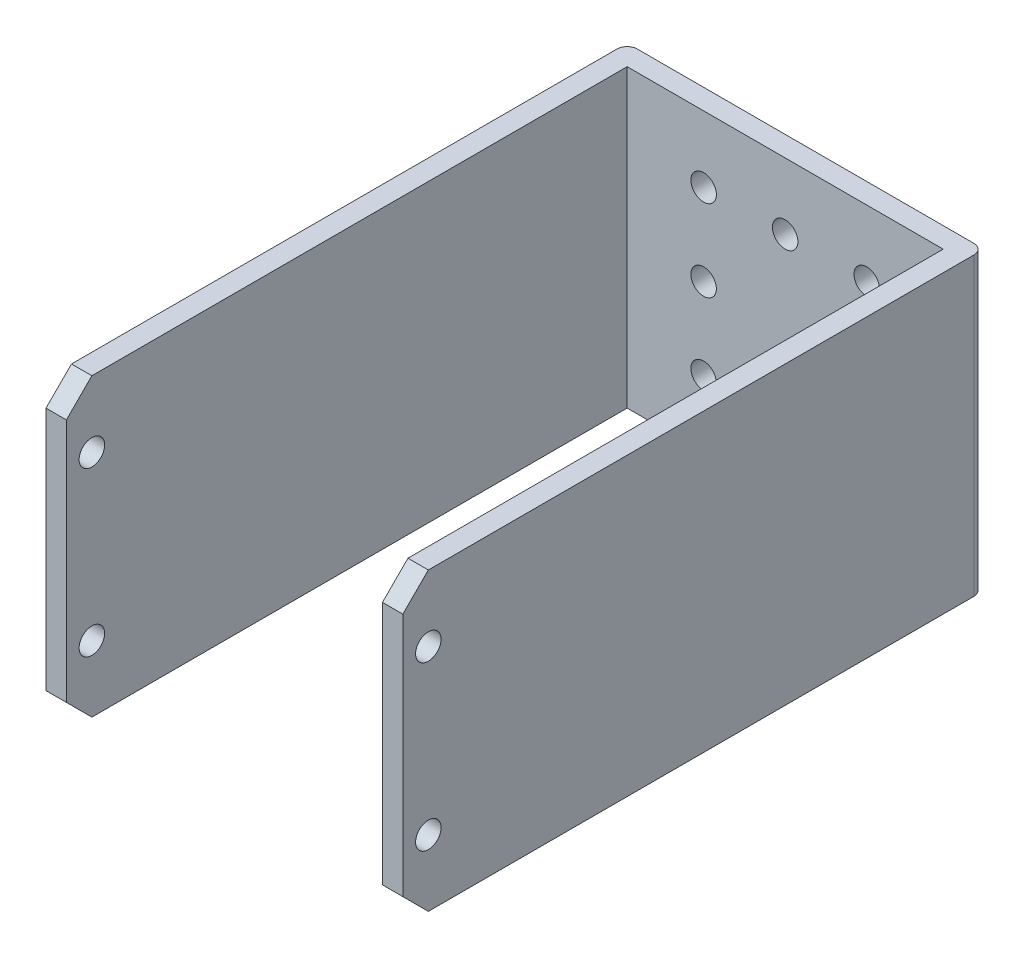
ISO-10303-21;
HEADER;
FILE_DESCRIPTION(('STEP AP214'),'2;1');
FILE_NAME('part.step','',(''),(''),'','','');
FILE_SCHEMA(('AUTOMOTIVE_DESIGN { 1 0 10303 214 1 1 1 1 }'));
ENDSEC;
DATA;
#1=APPLICATION_CONTEXT('core data for automotive mechanical design processes');
#2=APPLICATION_PROTOCOL_DEFINITION('international standard','automotive_design',2000,#1);
#3=PRODUCT_CONTEXT('',#1,'mechanical');
#4=PRODUCT('Part','Part','',(#3));
#5=PRODUCT_RELATED_PRODUCT_CATEGORY('part','',(#4));
#6=PRODUCT_DEFINITION_FORMATION('','',#4);
#7=PRODUCT_DEFINITION_CONTEXT('part definition',#1,'design');
#8=PRODUCT_DEFINITION('design','',#6,#7);
#9=PRODUCT_DEFINITION_SHAPE('','',#8);
#10=(LENGTH_UNIT() NAMED_UNIT(*) SI_UNIT(.MILLI.,.METRE.));
#11=(NAMED_UNIT(*) PLANE_ANGLE_UNIT() SI_UNIT($,.RADIAN.));
#12=(NAMED_UNIT(*) SI_UNIT($,.STERADIAN.) SOLID_ANGLE_UNIT());
#13=UNCERTAINTY_MEASURE_WITH_UNIT(LENGTH_MEASURE(1.E-05),#10,'distance_accuracy_value','');
#14=(GEOMETRIC_REPRESENTATION_CONTEXT(3) GLOBAL_UNCERTAINTY_ASSIGNED_CONTEXT((#13)) GLOBAL_UNIT_ASSIGNED_CONTEXT((#10,
#11,#12)) REPRESENTATION_CONTEXT('',''));
#15=CARTESIAN_POINT('',(0.,0.,0.));
#16=DIRECTION('',(0.,0.,1.));
#17=DIRECTION('',(1.,0.,0.));
#18=AXIS2_PLACEMENT_3D('',#15,#16,#17);
#19=CARTESIAN_POINT('',(0.,0.,57.));
#20=DIRECTION('',(0.,0.,1.));
#21=DIRECTION('',(1.,0.,0.));
#22=AXIS2_PLACEMENT_3D('',#19,#20,#21);
#23=PLANE('',#22);
#24=DIRECTION('',(0.,-1.,0.));
#25=VECTOR('',#24,1.);
#26=CARTESIAN_POINT('',(0.,0.,57.));
#27=LINE('',#26,#25);
#28=CARTESIAN_POINT('',(0.,26.5,57.));
#29=VERTEX_POINT('',#28);
#30=CARTESIAN_POINT('',(0.,2.5,57.));
#31=VERTEX_POINT('',#30);
#32=EDGE_CURVE('E193',#29,#31,#27,.T.);
#33=ORIENTED_EDGE('',*,*,#32,.T.);
#34=DIRECTION('',(1.,0.,0.));
#35=VECTOR('',#34,1.);
#36=CARTESIAN_POINT('',(2.,2.50000000000001,57.));
#37=LINE('',#36,#35);
#38=CARTESIAN_POINT('',(2.,2.50000000000001,57.));
#39=VERTEX_POINT('',#38);
#40=EDGE_CURVE('E250',#31,#39,#37,.T.);
#41=ORIENTED_EDGE('',*,*,#40,.T.);
#42=DIRECTION('',(0.,-1.,0.));
#43=VECTOR('',#42,1.);
#44=CARTESIAN_POINT('',(1.99999999999999,29.,57.));
#45=LINE('',#44,#43);
#46=CARTESIAN_POINT('',(1.99999999999999,26.5,57.));
#47=VERTEX_POINT('',#46);
#48=EDGE_CURVE('E178',#47,#39,#45,.T.);
#49=ORIENTED_EDGE('',*,*,#48,.F.);
#50=DIRECTION('',(-1.,0.,0.));
#51=VECTOR('',#50,1.);
#52=CARTESIAN_POINT('',(0.,26.5,57.));
#53=LINE('',#52,#51);
#54=EDGE_CURVE('E247',#47,#29,#53,.T.);
#55=ORIENTED_EDGE('',*,*,#54,.T.);
#56=EDGE_LOOP('',(#33,#41,#49,#55));
#57=FACE_BOUND('',#56,.T.);
#58=ADVANCED_FACE('F46',(#57),#23,.T.);
#59=CARTESIAN_POINT('',(35.,0.,57.));
#60=DIRECTION('',(-1.,0.,0.));
#61=DIRECTION('',(0.,0.,1.));
#62=AXIS2_PLACEMENT_3D('',#59,#60,#61);
#63=PLANE('',#62);
#64=CARTESIAN_POINT('',(35.,22.5,54.5));
#65=DIRECTION('',(-1.,0.,0.));
#66=DIRECTION('',(0.,0.,1.));
#67=AXIS2_PLACEMENT_3D('',#64,#65,#66);
#68=CIRCLE('',#67,1.25);
#69=CARTESIAN_POINT('',(35.,22.5,55.75));
#70=VERTEX_POINT('',#69);
#71=EDGE_CURVE('E180',#70,#70,#68,.T.);
#72=ORIENTED_EDGE('',*,*,#71,.T.);
#73=EDGE_LOOP('',(#72));
#74=FACE_BOUND('',#73,.T.);
#75=CARTESIAN_POINT('',(35.,6.5,54.5000000000002));
#76=DIRECTION('',(-1.,0.,0.));
#77=DIRECTION('',(0.,0.,1.));
#78=AXIS2_PLACEMENT_3D('',#75,#76,#77);
#79=CIRCLE('',#78,1.25000000000001);
#80=CARTESIAN_POINT('',(35.,6.5,55.7500000000002));
#81=VERTEX_POINT('',#80);
#82=EDGE_CURVE('E266',#81,#81,#79,.T.);
#83=ORIENTED_EDGE('',*,*,#82,.T.);
#84=EDGE_LOOP('',(#83));
#85=FACE_BOUND('',#84,.T.);
#86=DIRECTION('',(0.,1.,0.));
#87=VECTOR('',#86,1.);
#88=CARTESIAN_POINT('',(35.,0.,57.));
#89=LINE('',#88,#87);
#90=CARTESIAN_POINT('',(35.,2.50000000000001,57.));
#91=VERTEX_POINT('',#90);
#92=CARTESIAN_POINT('',(35.,26.5,57.));
#93=VERTEX_POINT('',#92);
#94=EDGE_CURVE('E190',#91,#93,#89,.T.);
#95=ORIENTED_EDGE('',*,*,#94,.F.);
#96=DIRECTION('',(0.,-0.707106781186547,-0.707106781186548));
#97=VECTOR('',#96,1.);
#98=CARTESIAN_POINT('',(35.,2.50000000000001,57.));
#99=LINE('',#98,#97);
#100=CARTESIAN_POINT('',(35.,0.,54.5));
#101=VERTEX_POINT('',#100);
#102=EDGE_CURVE('E237',#91,#101,#99,.T.);
#103=ORIENTED_EDGE('',*,*,#102,.T.);
#104=DIRECTION('',(0.,0.,-1.));
#105=VECTOR('',#104,1.);
#106=CARTESIAN_POINT('',(35.,0.,57.));
#107=LINE('',#106,#105);
#108=CARTESIAN_POINT('',(35.,0.,1.00000000000001));
#109=VERTEX_POINT('',#108);
#110=EDGE_CURVE('E197',#101,#109,#107,.T.);
#111=ORIENTED_EDGE('',*,*,#110,.T.);
#112=DIRECTION('',(0.,1.,0.));
#113=VECTOR('',#112,1.);
#114=CARTESIAN_POINT('',(35.,0.,1.));
#115=LINE('',#114,#113);
#116=CARTESIAN_POINT('',(35.,29.,1.00000000000001));
#117=VERTEX_POINT('',#116);
#118=EDGE_CURVE('E209',#109,#117,#115,.T.);
#119=ORIENTED_EDGE('',*,*,#118,.T.);
#120=DIRECTION('',(0.,0.,-1.));
#121=VECTOR('',#120,1.);
#122=CARTESIAN_POINT('',(35.,29.,57.));
#123=LINE('',#122,#121);
#124=CARTESIAN_POINT('',(35.,29.,54.5));
#125=VERTEX_POINT('',#124);
#126=EDGE_CURVE('E207',#125,#117,#123,.T.);
#127=ORIENTED_EDGE('',*,*,#126,.F.);
#128=DIRECTION('',(0.,-0.707106781186547,0.707106781186549));
#129=VECTOR('',#128,1.);
#130=CARTESIAN_POINT('',(35.,26.5,57.));
#131=LINE('',#130,#129);
#132=EDGE_CURVE('E235',#125,#93,#131,.T.);
#133=ORIENTED_EDGE('',*,*,#132,.T.);
#134=EDGE_LOOP('',(#95,#103,#111,#119,#127,#133));
#135=FACE_BOUND('',#134,.T.);
#136=ADVANCED_FACE('F286',(#74,#85,#135),#63,.F.);
#137=CARTESIAN_POINT('',(35.,29.,57.));
#138=DIRECTION('',(0.,-1.,0.));
#139=DIRECTION('',(1.,0.,0.));
#140=AXIS2_PLACEMENT_3D('',#137,#138,#139);
#141=PLANE('',#140);
#142=DIRECTION('',(0.,0.,1.));
#143=VECTOR('',#142,1.);
#144=CARTESIAN_POINT('',(33.,29.,2.));
#145=LINE('',#144,#143);
#146=CARTESIAN_POINT('',(33.,29.,2.));
#147=VERTEX_POINT('',#146);
#148=CARTESIAN_POINT('',(33.,29.,54.5));
#149=VERTEX_POINT('',#148);
#150=EDGE_CURVE('E186',#147,#149,#145,.T.);
#151=ORIENTED_EDGE('',*,*,#150,.T.);
#152=DIRECTION('',(1.,0.,0.));
#153=VECTOR('',#152,1.);
#154=CARTESIAN_POINT('',(35.,29.,54.5));
#155=LINE('',#154,#153);
#156=EDGE_CURVE('E13',#149,#125,#155,.T.);
#157=ORIENTED_EDGE('',*,*,#156,.T.);
#158=ORIENTED_EDGE('',*,*,#126,.T.);
#159=CARTESIAN_POINT('',(34.,29.,1.));
#160=DIRECTION('',(0.,-1.,0.));
#161=DIRECTION('',(1.,0.,0.));
#162=AXIS2_PLACEMENT_3D('',#159,#160,#161);
#163=CIRCLE('',#162,1.);
#164=CARTESIAN_POINT('',(34.,29.,0.));
#165=VERTEX_POINT('',#164);
#166=EDGE_CURVE('E215',#117,#165,#163,.F.);
#167=ORIENTED_EDGE('',*,*,#166,.T.);
#168=DIRECTION('',(-1.,0.,0.));
#169=VECTOR('',#168,1.);
#170=CARTESIAN_POINT('',(35.,29.,0.));
#171=LINE('',#170,#169);
#172=CARTESIAN_POINT('',(1.,29.,0.));
#173=VERTEX_POINT('',#172);
#174=EDGE_CURVE('E185',#165,#173,#171,.T.);
#175=ORIENTED_EDGE('',*,*,#174,.T.);
#176=CARTESIAN_POINT('',(1.,29.,1.));
#177=DIRECTION('',(0.,-1.,0.));
#178=DIRECTION('',(1.,0.,0.));
#179=AXIS2_PLACEMENT_3D('',#176,#177,#178);
#180=CIRCLE('',#179,1.);
#181=CARTESIAN_POINT('',(0.,29.,1.00000000000001));
#182=VERTEX_POINT('',#181);
#183=EDGE_CURVE('E212',#173,#182,#180,.F.);
#184=ORIENTED_EDGE('',*,*,#183,.T.);
#185=DIRECTION('',(0.,0.,-1.));
#186=VECTOR('',#185,1.);
#187=CARTESIAN_POINT('',(0.,29.,57.));
#188=LINE('',#187,#186);
#189=CARTESIAN_POINT('',(0.,29.,54.5));
#190=VERTEX_POINT('',#189);
#191=EDGE_CURVE('E205',#190,#182,#188,.T.);
#192=ORIENTED_EDGE('',*,*,#191,.F.);
#193=DIRECTION('',(1.,0.,0.));
#194=VECTOR('',#193,1.);
#195=CARTESIAN_POINT('',(1.99999999999999,29.,54.5));
#196=LINE('',#195,#194);
#197=CARTESIAN_POINT('',(1.99999999999999,29.,54.5));
#198=VERTEX_POINT('',#197);
#199=EDGE_CURVE('E55',#190,#198,#196,.T.);
#200=ORIENTED_EDGE('',*,*,#199,.T.);
#201=DIRECTION('',(0.,0.,1.));
#202=VECTOR('',#201,1.);
#203=CARTESIAN_POINT('',(1.99999999999999,29.,2.));
#204=LINE('',#203,#202);
#205=CARTESIAN_POINT('',(1.99999999999999,29.,2.));
#206=VERTEX_POINT('',#205);
#207=EDGE_CURVE('E183',#206,#198,#204,.T.);
#208=ORIENTED_EDGE('',*,*,#207,.F.);
#209=DIRECTION('',(-1.,0.,0.));
#210=VECTOR('',#209,1.);
#211=CARTESIAN_POINT('',(1.99999999999999,29.,2.));
#212=LINE('',#211,#210);
#213=EDGE_CURVE('E158',#147,#206,#212,.T.);
#214=ORIENTED_EDGE('',*,*,#213,.F.);
#215=EDGE_LOOP('',(#151,#157,#158,#167,#175,#184,#192,#200,#208,#214));
#216=FACE_BOUND('',#215,.T.);
#217=ADVANCED_FACE('F314',(#216),#141,.F.);
#218=CARTESIAN_POINT('',(0.,0.,57.));
#219=DIRECTION('',(1.,0.,0.));
#220=DIRECTION('',(0.,1.,0.));
#221=AXIS2_PLACEMENT_3D('',#218,#219,#220);
#222=PLANE('',#221);
#223=CARTESIAN_POINT('',(0.,22.5,54.5));
#224=DIRECTION('',(-1.,0.,0.));
#225=DIRECTION('',(0.,-1.,0.));
#226=AXIS2_PLACEMENT_3D('',#223,#224,#225);
#227=CIRCLE('',#226,1.25);
#228=CARTESIAN_POINT('',(0.,21.25,54.5));
#229=VERTEX_POINT('',#228);
#230=EDGE_CURVE('E262',#229,#229,#227,.T.);
#231=ORIENTED_EDGE('',*,*,#230,.F.);
#232=EDGE_LOOP('',(#231));
#233=FACE_BOUND('',#232,.T.);
#234=CARTESIAN_POINT('',(0.,6.5,54.5000000000002));
#235=DIRECTION('',(-1.,0.,0.));
#236=DIRECTION('',(0.,-1.,0.));
#237=AXIS2_PLACEMENT_3D('',#234,#235,#236);
#238=CIRCLE('',#237,1.25000000000001);
#239=CARTESIAN_POINT('',(0.,5.24999999999999,54.5000000000002));
#240=VERTEX_POINT('',#239);
#241=EDGE_CURVE('E269',#240,#240,#238,.T.);
#242=ORIENTED_EDGE('',*,*,#241,.F.);
#243=EDGE_LOOP('',(#242));
#244=FACE_BOUND('',#243,.T.);
#245=DIRECTION('',(0.,0.,-1.));
#246=VECTOR('',#245,1.);
#247=CARTESIAN_POINT('',(0.,0.,57.));
#248=LINE('',#247,#246);
#249=CARTESIAN_POINT('',(0.,0.,54.5));
#250=VERTEX_POINT('',#249);
#251=CARTESIAN_POINT('',(0.,0.,1.00000000000001));
#252=VERTEX_POINT('',#251);
#253=EDGE_CURVE('E203',#250,#252,#248,.T.);
#254=ORIENTED_EDGE('',*,*,#253,.F.);
#255=DIRECTION('',(0.,0.707106781186547,0.707106781186548));
#256=VECTOR('',#255,1.);
#257=CARTESIAN_POINT('',(0.,2.50000000000001,57.));
#258=LINE('',#257,#256);
#259=EDGE_CURVE('E257',#250,#31,#258,.T.);
#260=ORIENTED_EDGE('',*,*,#259,.T.);
#261=ORIENTED_EDGE('',*,*,#32,.F.);
#262=DIRECTION('',(0.,0.707106781186547,-0.707106781186549));
#263=VECTOR('',#262,1.);
#264=CARTESIAN_POINT('',(0.,26.5,57.));
#265=LINE('',#264,#263);
#266=EDGE_CURVE('E63',#29,#190,#265,.T.);
#267=ORIENTED_EDGE('',*,*,#266,.T.);
#268=ORIENTED_EDGE('',*,*,#191,.T.);
#269=DIRECTION('',(0.,-1.,0.));
#270=VECTOR('',#269,1.);
#271=CARTESIAN_POINT('',(0.,0.,1.));
#272=LINE('',#271,#270);
#273=EDGE_CURVE('E226',#182,#252,#272,.T.);
#274=ORIENTED_EDGE('',*,*,#273,.T.);
#275=EDGE_LOOP('',(#254,#260,#261,#267,#268,#274));
#276=FACE_BOUND('',#275,.T.);
#277=ADVANCED_FACE('F326',(#233,#244,#276),#222,.F.);
#278=CARTESIAN_POINT('',(35.,0.,57.));
#279=DIRECTION('',(0.,1.,0.));
#280=DIRECTION('',(-1.,0.,0.));
#281=AXIS2_PLACEMENT_3D('',#278,#279,#280);
#282=PLANE('',#281);
#283=ORIENTED_EDGE('',*,*,#110,.F.);
#284=DIRECTION('',(-1.,0.,0.));
#285=VECTOR('',#284,1.);
#286=CARTESIAN_POINT('',(33.,0.,54.5));
#287=LINE('',#286,#285);
#288=CARTESIAN_POINT('',(33.,0.,54.5));
#289=VERTEX_POINT('',#288);
#290=EDGE_CURVE('E241',#101,#289,#287,.T.);
#291=ORIENTED_EDGE('',*,*,#290,.T.);
#292=DIRECTION('',(0.,0.,1.));
#293=VECTOR('',#292,1.);
#294=CARTESIAN_POINT('',(33.,0.,2.));
#295=LINE('',#294,#293);
#296=CARTESIAN_POINT('',(33.,0.,2.));
#297=VERTEX_POINT('',#296);
#298=EDGE_CURVE('E157',#297,#289,#295,.T.);
#299=ORIENTED_EDGE('',*,*,#298,.F.);
#300=DIRECTION('',(1.,0.,0.));
#301=VECTOR('',#300,1.);
#302=CARTESIAN_POINT('',(2.,0.,2.));
#303=LINE('',#302,#301);
#304=CARTESIAN_POINT('',(2.,0.,2.));
#305=VERTEX_POINT('',#304);
#306=EDGE_CURVE('E164',#305,#297,#303,.T.);
#307=ORIENTED_EDGE('',*,*,#306,.F.);
#308=DIRECTION('',(0.,0.,1.));
#309=VECTOR('',#308,1.);
#310=CARTESIAN_POINT('',(2.,0.,2.));
#311=LINE('',#310,#309);
#312=CARTESIAN_POINT('',(2.,0.,54.5));
#313=VERTEX_POINT('',#312);
#314=EDGE_CURVE('E147',#305,#313,#311,.T.);
#315=ORIENTED_EDGE('',*,*,#314,.T.);
#316=DIRECTION('',(-1.,0.,0.));
#317=VECTOR('',#316,1.);
#318=CARTESIAN_POINT('',(0.,0.,54.5));
#319=LINE('',#318,#317);
#320=EDGE_CURVE('E239',#313,#250,#319,.T.);
#321=ORIENTED_EDGE('',*,*,#320,.T.);
#322=ORIENTED_EDGE('',*,*,#253,.T.);
#323=CARTESIAN_POINT('',(1.,0.,1.));
#324=DIRECTION('',(0.,1.,0.));
#325=DIRECTION('',(-1.,0.,0.));
#326=AXIS2_PLACEMENT_3D('',#323,#324,#325);
#327=CIRCLE('',#326,1.);
#328=CARTESIAN_POINT('',(1.,0.,0.));
#329=VERTEX_POINT('',#328);
#330=EDGE_CURVE('E221',#252,#329,#327,.F.);
#331=ORIENTED_EDGE('',*,*,#330,.T.);
#332=DIRECTION('',(1.,0.,0.));
#333=VECTOR('',#332,1.);
#334=CARTESIAN_POINT('',(35.,0.,0.));
#335=LINE('',#334,#333);
#336=CARTESIAN_POINT('',(34.,0.,0.));
#337=VERTEX_POINT('',#336);
#338=EDGE_CURVE('E194',#329,#337,#335,.T.);
#339=ORIENTED_EDGE('',*,*,#338,.T.);
#340=CARTESIAN_POINT('',(34.,0.,1.));
#341=DIRECTION('',(0.,1.,0.));
#342=DIRECTION('',(-1.,0.,0.));
#343=AXIS2_PLACEMENT_3D('',#340,#341,#342);
#344=CIRCLE('',#343,1.);
#345=EDGE_CURVE('E223',#337,#109,#344,.F.);
#346=ORIENTED_EDGE('',*,*,#345,.T.);
#347=EDGE_LOOP('',(#283,#291,#299,#307,#315,#321,#322,#331,#339,#346));
#348=FACE_BOUND('',#347,.T.);
#349=ADVANCED_FACE('F170',(#348),#282,.F.);
#350=DIRECTION('',(0.,1.,0.));
#351=VECTOR('',#350,1.);
#352=CARTESIAN_POINT('',(33.,29.,57.));
#353=LINE('',#352,#351);
#354=CARTESIAN_POINT('',(33.,2.50000000000001,57.));
#355=VERTEX_POINT('',#354);
#356=CARTESIAN_POINT('',(33.,26.5,57.));
#357=VERTEX_POINT('',#356);
#358=EDGE_CURVE('E167',#355,#357,#353,.T.);
#359=ORIENTED_EDGE('',*,*,#358,.F.);
#360=DIRECTION('',(1.,0.,0.));
#361=VECTOR('',#360,1.);
#362=CARTESIAN_POINT('',(35.,2.50000000000001,57.));
#363=LINE('',#362,#361);
#364=EDGE_CURVE('E232',#355,#91,#363,.T.);
#365=ORIENTED_EDGE('',*,*,#364,.T.);
#366=ORIENTED_EDGE('',*,*,#94,.T.);
#367=DIRECTION('',(-1.,0.,0.));
#368=VECTOR('',#367,1.);
#369=CARTESIAN_POINT('',(33.,26.5,57.));
#370=LINE('',#369,#368);
#371=EDGE_CURVE('E229',#93,#357,#370,.T.);
#372=ORIENTED_EDGE('',*,*,#371,.T.);
#373=EDGE_LOOP('',(#359,#365,#366,#372));
#374=FACE_BOUND('',#373,.T.);
#375=ADVANCED_FACE('F310',(#374),#23,.T.);
#376=CARTESIAN_POINT('',(0.,0.,0.));
#377=DIRECTION('',(0.,0.,1.));
#378=DIRECTION('',(1.,0.,0.));
#379=AXIS2_PLACEMENT_3D('',#376,#377,#378);
#380=PLANE('',#379);
#381=CARTESIAN_POINT('',(9.49999999999999,22.5,0.));
#382=DIRECTION('',(0.,0.,1.));
#383=DIRECTION('',(1.,0.,0.));
#384=AXIS2_PLACEMENT_3D('',#381,#382,#383);
#385=CIRCLE('',#384,1.25);
#386=CARTESIAN_POINT('',(10.75,22.5,0.));
#387=VERTEX_POINT('',#386);
#388=EDGE_CURVE('E274',#387,#387,#385,.T.);
#389=ORIENTED_EDGE('',*,*,#388,.T.);
#390=EDGE_LOOP('',(#389));
#391=FACE_BOUND('',#390,.T.);
#392=CARTESIAN_POINT('',(9.49999999999999,14.5,0.));
#393=DIRECTION('',(0.,0.,1.));
#394=DIRECTION('',(1.,0.,0.));
#395=AXIS2_PLACEMENT_3D('',#392,#393,#394);
#396=CIRCLE('',#395,1.25);
#397=CARTESIAN_POINT('',(10.75,14.5,0.));
#398=VERTEX_POINT('',#397);
#399=EDGE_CURVE('E517',#398,#398,#396,.T.);
#400=ORIENTED_EDGE('',*,*,#399,.T.);
#401=EDGE_LOOP('',(#400));
#402=FACE_BOUND('',#401,.T.);
#403=CARTESIAN_POINT('',(9.49999999999999,6.5,0.));
#404=DIRECTION('',(0.,0.,1.));
#405=DIRECTION('',(1.,0.,0.));
#406=AXIS2_PLACEMENT_3D('',#403,#404,#405);
#407=CIRCLE('',#406,1.25);
#408=CARTESIAN_POINT('',(10.75,6.5,0.));
#409=VERTEX_POINT('',#408);
#410=EDGE_CURVE('E519',#409,#409,#407,.T.);
#411=ORIENTED_EDGE('',*,*,#410,.T.);
#412=EDGE_LOOP('',(#411));
#413=FACE_BOUND('',#412,.T.);
#414=CARTESIAN_POINT('',(25.5,22.5000000000002,0.));
#415=DIRECTION('',(0.,0.,1.));
#416=DIRECTION('',(1.,0.,0.));
#417=AXIS2_PLACEMENT_3D('',#414,#415,#416);
#418=CIRCLE('',#417,1.25);
#419=CARTESIAN_POINT('',(26.75,22.5000000000002,0.));
#420=VERTEX_POINT('',#419);
#421=EDGE_CURVE('E523',#420,#420,#418,.T.);
#422=ORIENTED_EDGE('',*,*,#421,.T.);
#423=EDGE_LOOP('',(#422));
#424=FACE_BOUND('',#423,.T.);
#425=CARTESIAN_POINT('',(17.5,22.5000000000001,0.));
#426=DIRECTION('',(0.,0.,1.));
#427=DIRECTION('',(1.,0.,0.));
#428=AXIS2_PLACEMENT_3D('',#425,#426,#427);
#429=CIRCLE('',#428,1.25);
#430=CARTESIAN_POINT('',(18.75,22.5000000000001,0.));
#431=VERTEX_POINT('',#430);
#432=EDGE_CURVE('E528',#431,#431,#429,.T.);
#433=ORIENTED_EDGE('',*,*,#432,.T.);
#434=EDGE_LOOP('',(#433));
#435=FACE_BOUND('',#434,.T.);
#436=CARTESIAN_POINT('',(25.5,14.5000000000002,0.));
#437=DIRECTION('',(0.,0.,1.));
#438=DIRECTION('',(1.,0.,0.));
#439=AXIS2_PLACEMENT_3D('',#436,#437,#438);
#440=CIRCLE('',#439,1.25);
#441=CARTESIAN_POINT('',(26.75,14.5000000000002,0.));
#442=VERTEX_POINT('',#441);
#443=EDGE_CURVE('E531',#442,#442,#440,.T.);
#444=ORIENTED_EDGE('',*,*,#443,.T.);
#445=EDGE_LOOP('',(#444));
#446=FACE_BOUND('',#445,.T.);
#447=CARTESIAN_POINT('',(25.5,6.50000000000022,0.));
#448=DIRECTION('',(0.,0.,1.));
#449=DIRECTION('',(1.,0.,0.));
#450=AXIS2_PLACEMENT_3D('',#447,#448,#449);
#451=CIRCLE('',#450,1.25);
#452=CARTESIAN_POINT('',(26.75,6.50000000000022,0.));
#453=VERTEX_POINT('',#452);
#454=EDGE_CURVE('E534',#453,#453,#451,.T.);
#455=ORIENTED_EDGE('',*,*,#454,.T.);
#456=EDGE_LOOP('',(#455));
#457=FACE_BOUND('',#456,.T.);
#458=CARTESIAN_POINT('',(17.5,6.50000000000011,0.));
#459=DIRECTION('',(0.,0.,1.));
#460=DIRECTION('',(1.,0.,0.));
#461=AXIS2_PLACEMENT_3D('',#458,#459,#460);
#462=CIRCLE('',#461,1.25);
#463=CARTESIAN_POINT('',(18.75,6.50000000000011,0.));
#464=VERTEX_POINT('',#463);
#465=EDGE_CURVE('E537',#464,#464,#462,.T.);
#466=ORIENTED_EDGE('',*,*,#465,.T.);
#467=EDGE_LOOP('',(#466));
#468=FACE_BOUND('',#467,.T.);
#469=ORIENTED_EDGE('',*,*,#174,.F.);
#470=DIRECTION('',(0.,1.,0.));
#471=VECTOR('',#470,1.);
#472=CARTESIAN_POINT('',(34.,0.,0.));
#473=LINE('',#472,#471);
#474=EDGE_CURVE('E219',#165,#337,#473,.F.);
#475=ORIENTED_EDGE('',*,*,#474,.T.);
#476=ORIENTED_EDGE('',*,*,#338,.F.);
#477=DIRECTION('',(0.,-1.,0.));
#478=VECTOR('',#477,1.);
#479=CARTESIAN_POINT('',(1.,0.,0.));
#480=LINE('',#479,#478);
#481=EDGE_CURVE('E217',#329,#173,#480,.F.);
#482=ORIENTED_EDGE('',*,*,#481,.T.);
#483=EDGE_LOOP('',(#469,#475,#476,#482));
#484=FACE_BOUND('',#483,.T.);
#485=ADVANCED_FACE('F319',(#391,#402,#413,#424,#435,#446,#457,#468,#484),#380,.F.);
#486=CARTESIAN_POINT('',(1.99999999999999,29.,2.));
#487=DIRECTION('',(-1.,0.,0.));
#488=DIRECTION('',(0.,-1.,0.));
#489=AXIS2_PLACEMENT_3D('',#486,#487,#488);
#490=PLANE('',#489);
#491=CARTESIAN_POINT('',(1.99999999999999,22.5,54.5));
#492=DIRECTION('',(-1.,0.,0.));
#493=DIRECTION('',(0.,-1.,0.));
#494=AXIS2_PLACEMENT_3D('',#491,#492,#493);
#495=CIRCLE('',#494,1.25);
#496=CARTESIAN_POINT('',(2.,21.25,54.5));
#497=VERTEX_POINT('',#496);
#498=EDGE_CURVE('E281',#497,#497,#495,.T.);
#499=ORIENTED_EDGE('',*,*,#498,.T.);
#500=EDGE_LOOP('',(#499));
#501=FACE_BOUND('',#500,.T.);
#502=CARTESIAN_POINT('',(2.,6.5,54.5000000000002));
#503=DIRECTION('',(-1.,0.,0.));
#504=DIRECTION('',(0.,-1.,0.));
#505=AXIS2_PLACEMENT_3D('',#502,#503,#504);
#506=CIRCLE('',#505,1.25000000000001);
#507=CARTESIAN_POINT('',(2.,5.24999999999999,54.5000000000002));
#508=VERTEX_POINT('',#507);
#509=EDGE_CURVE('E261',#508,#508,#506,.T.);
#510=ORIENTED_EDGE('',*,*,#509,.T.);
#511=EDGE_LOOP('',(#510));
#512=FACE_BOUND('',#511,.T.);
#513=ORIENTED_EDGE('',*,*,#48,.T.);
#514=DIRECTION('',(0.,-0.707106781186547,-0.707106781186548));
#515=VECTOR('',#514,1.);
#516=CARTESIAN_POINT('',(2.,2.50000000000001,57.));
#517=LINE('',#516,#515);
#518=EDGE_CURVE('E153',#39,#313,#517,.T.);
#519=ORIENTED_EDGE('',*,*,#518,.T.);
#520=ORIENTED_EDGE('',*,*,#314,.F.);
#521=DIRECTION('',(0.,-1.,0.));
#522=VECTOR('',#521,1.);
#523=CARTESIAN_POINT('',(1.99999999999999,29.,2.));
#524=LINE('',#523,#522);
#525=EDGE_CURVE('E151',#206,#305,#524,.T.);
#526=ORIENTED_EDGE('',*,*,#525,.F.);
#527=ORIENTED_EDGE('',*,*,#207,.T.);
#528=DIRECTION('',(0.,-0.707106781186547,0.707106781186549));
#529=VECTOR('',#528,1.);
#530=CARTESIAN_POINT('',(1.99999999999999,26.5,57.));
#531=LINE('',#530,#529);
#532=EDGE_CURVE('E253',#198,#47,#531,.T.);
#533=ORIENTED_EDGE('',*,*,#532,.T.);
#534=EDGE_LOOP('',(#513,#519,#520,#526,#527,#533));
#535=FACE_BOUND('',#534,.T.);
#536=ADVANCED_FACE('F150',(#501,#512,#535),#490,.F.);
#537=CARTESIAN_POINT('',(33.,29.,2.));
#538=DIRECTION('',(1.,0.,0.));
#539=DIRECTION('',(0.,0.,-1.));
#540=AXIS2_PLACEMENT_3D('',#537,#538,#539);
#541=PLANE('',#540);
#542=CARTESIAN_POINT('',(33.,22.5,54.5));
#543=DIRECTION('',(1.,0.,0.));
#544=DIRECTION('',(0.,0.,-1.));
#545=AXIS2_PLACEMENT_3D('',#542,#543,#544);
#546=CIRCLE('',#545,1.25);
#547=CARTESIAN_POINT('',(33.,22.5,53.25));
#548=VERTEX_POINT('',#547);
#549=EDGE_CURVE('E50',#548,#548,#546,.T.);
#550=ORIENTED_EDGE('',*,*,#549,.T.);
#551=EDGE_LOOP('',(#550));
#552=FACE_BOUND('',#551,.T.);
#553=CARTESIAN_POINT('',(33.,6.5,54.5000000000002));
#554=DIRECTION('',(1.,0.,0.));
#555=DIRECTION('',(0.,0.,-1.));
#556=AXIS2_PLACEMENT_3D('',#553,#554,#555);
#557=CIRCLE('',#556,1.25000000000001);
#558=CARTESIAN_POINT('',(33.,6.5,53.2500000000002));
#559=VERTEX_POINT('',#558);
#560=EDGE_CURVE('E259',#559,#559,#557,.T.);
#561=ORIENTED_EDGE('',*,*,#560,.T.);
#562=EDGE_LOOP('',(#561));
#563=FACE_BOUND('',#562,.T.);
#564=ORIENTED_EDGE('',*,*,#298,.T.);
#565=DIRECTION('',(0.,0.707106781186547,0.707106781186548));
#566=VECTOR('',#565,1.);
#567=CARTESIAN_POINT('',(33.,2.50000000000001,57.));
#568=LINE('',#567,#566);
#569=EDGE_CURVE('E245',#289,#355,#568,.T.);
#570=ORIENTED_EDGE('',*,*,#569,.T.);
#571=ORIENTED_EDGE('',*,*,#358,.T.);
#572=DIRECTION('',(0.,0.707106781186547,-0.707106781186549));
#573=VECTOR('',#572,1.);
#574=CARTESIAN_POINT('',(33.,26.5,57.));
#575=LINE('',#574,#573);
#576=EDGE_CURVE('E243',#357,#149,#575,.T.);
#577=ORIENTED_EDGE('',*,*,#576,.T.);
#578=ORIENTED_EDGE('',*,*,#150,.F.);
#579=DIRECTION('',(0.,1.,0.));
#580=VECTOR('',#579,1.);
#581=CARTESIAN_POINT('',(33.,29.,2.));
#582=LINE('',#581,#580);
#583=EDGE_CURVE('E172',#297,#147,#582,.T.);
#584=ORIENTED_EDGE('',*,*,#583,.F.);
#585=EDGE_LOOP('',(#564,#570,#571,#577,#578,#584));
#586=FACE_BOUND('',#585,.T.);
#587=ADVANCED_FACE('F350',(#552,#563,#586),#541,.F.);
#588=CARTESIAN_POINT('',(0.,0.,2.));
#589=DIRECTION('',(0.,0.,1.));
#590=DIRECTION('',(1.,0.,0.));
#591=AXIS2_PLACEMENT_3D('',#588,#589,#590);
#592=PLANE('',#591);
#593=CARTESIAN_POINT('',(9.49999999999999,22.5,2.));
#594=DIRECTION('',(0.,0.,1.));
#595=DIRECTION('',(1.,0.,0.));
#596=AXIS2_PLACEMENT_3D('',#593,#594,#595);
#597=CIRCLE('',#596,1.25);
#598=CARTESIAN_POINT('',(10.75,22.5,2.));
#599=VERTEX_POINT('',#598);
#600=EDGE_CURVE('E514',#599,#599,#597,.T.);
#601=ORIENTED_EDGE('',*,*,#600,.F.);
#602=EDGE_LOOP('',(#601));
#603=FACE_BOUND('',#602,.T.);
#604=CARTESIAN_POINT('',(9.49999999999999,14.5,2.));
#605=DIRECTION('',(0.,0.,1.));
#606=DIRECTION('',(1.,0.,0.));
#607=AXIS2_PLACEMENT_3D('',#604,#605,#606);
#608=CIRCLE('',#607,1.25);
#609=CARTESIAN_POINT('',(10.75,14.5,2.));
#610=VERTEX_POINT('',#609);
#611=EDGE_CURVE('E545',#610,#610,#608,.T.);
#612=ORIENTED_EDGE('',*,*,#611,.F.);
#613=EDGE_LOOP('',(#612));
#614=FACE_BOUND('',#613,.T.);
#615=CARTESIAN_POINT('',(9.49999999999999,6.5,2.));
#616=DIRECTION('',(0.,0.,1.));
#617=DIRECTION('',(1.,0.,0.));
#618=AXIS2_PLACEMENT_3D('',#615,#616,#617);
#619=CIRCLE('',#618,1.25);
#620=CARTESIAN_POINT('',(10.75,6.5,2.));
#621=VERTEX_POINT('',#620);
#622=EDGE_CURVE('E548',#621,#621,#619,.T.);
#623=ORIENTED_EDGE('',*,*,#622,.F.);
#624=EDGE_LOOP('',(#623));
#625=FACE_BOUND('',#624,.T.);
#626=CARTESIAN_POINT('',(25.5,22.5000000000002,2.));
#627=DIRECTION('',(0.,0.,1.));
#628=DIRECTION('',(1.,0.,0.));
#629=AXIS2_PLACEMENT_3D('',#626,#627,#628);
#630=CIRCLE('',#629,1.25);
#631=CARTESIAN_POINT('',(26.75,22.5000000000002,2.));
#632=VERTEX_POINT('',#631);
#633=EDGE_CURVE('E551',#632,#632,#630,.T.);
#634=ORIENTED_EDGE('',*,*,#633,.F.);
#635=EDGE_LOOP('',(#634));
#636=FACE_BOUND('',#635,.T.);
#637=CARTESIAN_POINT('',(17.5,22.5000000000001,2.));
#638=DIRECTION('',(0.,0.,1.));
#639=DIRECTION('',(1.,0.,0.));
#640=AXIS2_PLACEMENT_3D('',#637,#638,#639);
#641=CIRCLE('',#640,1.25);
#642=CARTESIAN_POINT('',(18.75,22.5000000000001,2.));
#643=VERTEX_POINT('',#642);
#644=EDGE_CURVE('E554',#643,#643,#641,.T.);
#645=ORIENTED_EDGE('',*,*,#644,.F.);
#646=EDGE_LOOP('',(#645));
#647=FACE_BOUND('',#646,.T.);
#648=CARTESIAN_POINT('',(25.5,14.5000000000002,2.));
#649=DIRECTION('',(0.,0.,1.));
#650=DIRECTION('',(1.,0.,0.));
#651=AXIS2_PLACEMENT_3D('',#648,#649,#650);
#652=CIRCLE('',#651,1.25);
#653=CARTESIAN_POINT('',(26.75,14.5000000000002,2.));
#654=VERTEX_POINT('',#653);
#655=EDGE_CURVE('E557',#654,#654,#652,.T.);
#656=ORIENTED_EDGE('',*,*,#655,.F.);
#657=EDGE_LOOP('',(#656));
#658=FACE_BOUND('',#657,.T.);
#659=CARTESIAN_POINT('',(25.5,6.50000000000022,2.));
#660=DIRECTION('',(0.,0.,1.));
#661=DIRECTION('',(1.,0.,0.));
#662=AXIS2_PLACEMENT_3D('',#659,#660,#661);
#663=CIRCLE('',#662,1.25);
#664=CARTESIAN_POINT('',(26.75,6.50000000000022,2.));
#665=VERTEX_POINT('',#664);
#666=EDGE_CURVE('E543',#665,#665,#663,.T.);
#667=ORIENTED_EDGE('',*,*,#666,.F.);
#668=EDGE_LOOP('',(#667));
#669=FACE_BOUND('',#668,.T.);
#670=CARTESIAN_POINT('',(17.5,6.50000000000011,2.));
#671=DIRECTION('',(0.,0.,1.));
#672=DIRECTION('',(1.,0.,0.));
#673=AXIS2_PLACEMENT_3D('',#670,#671,#672);
#674=CIRCLE('',#673,1.25);
#675=CARTESIAN_POINT('',(18.75,6.50000000000011,2.));
#676=VERTEX_POINT('',#675);
#677=EDGE_CURVE('E540',#676,#676,#674,.T.);
#678=ORIENTED_EDGE('',*,*,#677,.F.);
#679=EDGE_LOOP('',(#678));
#680=FACE_BOUND('',#679,.T.);
#681=ORIENTED_EDGE('',*,*,#525,.T.);
#682=ORIENTED_EDGE('',*,*,#306,.T.);
#683=ORIENTED_EDGE('',*,*,#583,.T.);
#684=ORIENTED_EDGE('',*,*,#213,.T.);
#685=EDGE_LOOP('',(#681,#682,#683,#684));
#686=FACE_BOUND('',#685,.T.);
#687=ADVANCED_FACE('F162',(#603,#614,#625,#636,#647,#658,#669,#680,#686),#592,.T.);
#688=CARTESIAN_POINT('',(34.,0.,1.));
#689=DIRECTION('',(0.,1.,0.));
#690=DIRECTION('',(0.,0.,1.));
#691=AXIS2_PLACEMENT_3D('',#688,#689,#690);
#692=CYLINDRICAL_SURFACE('',#691,1.);
#693=ORIENTED_EDGE('',*,*,#345,.F.);
#694=ORIENTED_EDGE('',*,*,#474,.F.);
#695=ORIENTED_EDGE('',*,*,#166,.F.);
#696=ORIENTED_EDGE('',*,*,#118,.F.);
#697=EDGE_LOOP('',(#693,#694,#695,#696));
#698=FACE_BOUND('',#697,.T.);
#699=ADVANCED_FACE('F344',(#698),#692,.T.);
#700=CARTESIAN_POINT('',(1.,0.,1.));
#701=DIRECTION('',(0.,-1.,0.));
#702=DIRECTION('',(1.,0.,0.));
#703=AXIS2_PLACEMENT_3D('',#700,#701,#702);
#704=CYLINDRICAL_SURFACE('',#703,1.);
#705=ORIENTED_EDGE('',*,*,#183,.F.);
#706=ORIENTED_EDGE('',*,*,#481,.F.);
#707=ORIENTED_EDGE('',*,*,#330,.F.);
#708=ORIENTED_EDGE('',*,*,#273,.F.);
#709=EDGE_LOOP('',(#705,#706,#707,#708));
#710=FACE_BOUND('',#709,.T.);
#711=ADVANCED_FACE('F365',(#710),#704,.T.);
#712=CARTESIAN_POINT('',(0.,2.50000000000001,57.));
#713=DIRECTION('',(0.,-0.707106781186548,0.707106781186547));
#714=DIRECTION('',(-1.,0.,0.));
#715=AXIS2_PLACEMENT_3D('',#712,#713,#714);
#716=PLANE('',#715);
#717=ORIENTED_EDGE('',*,*,#569,.F.);
#718=ORIENTED_EDGE('',*,*,#290,.F.);
#719=ORIENTED_EDGE('',*,*,#102,.F.);
#720=ORIENTED_EDGE('',*,*,#364,.F.);
#721=EDGE_LOOP('',(#717,#718,#719,#720));
#722=FACE_BOUND('',#721,.T.);
#723=ADVANCED_FACE('F335',(#722),#716,.T.);
#724=CARTESIAN_POINT('',(0.,2.50000000000001,57.));
#725=DIRECTION('',(0.,-0.707106781186548,0.707106781186547));
#726=DIRECTION('',(-1.,0.,0.));
#727=AXIS2_PLACEMENT_3D('',#724,#725,#726);
#728=PLANE('',#727);
#729=ORIENTED_EDGE('',*,*,#259,.F.);
#730=ORIENTED_EDGE('',*,*,#320,.F.);
#731=ORIENTED_EDGE('',*,*,#518,.F.);
#732=ORIENTED_EDGE('',*,*,#40,.F.);
#733=EDGE_LOOP('',(#729,#730,#731,#732));
#734=FACE_BOUND('',#733,.T.);
#735=ADVANCED_FACE('F359',(#734),#728,.T.);
#736=CARTESIAN_POINT('',(0.,26.5,57.));
#737=DIRECTION('',(0.,0.707106781186548,0.707106781186546));
#738=DIRECTION('',(1.,0.,0.));
#739=AXIS2_PLACEMENT_3D('',#736,#737,#738);
#740=PLANE('',#739);
#741=ORIENTED_EDGE('',*,*,#132,.F.);
#742=ORIENTED_EDGE('',*,*,#156,.F.);
#743=ORIENTED_EDGE('',*,*,#576,.F.);
#744=ORIENTED_EDGE('',*,*,#371,.F.);
#745=EDGE_LOOP('',(#741,#742,#743,#744));
#746=FACE_BOUND('',#745,.T.);
#747=ADVANCED_FACE('F349',(#746),#740,.T.);
#748=CARTESIAN_POINT('',(0.,26.5,57.));
#749=DIRECTION('',(0.,0.707106781186548,0.707106781186546));
#750=DIRECTION('',(1.,0.,0.));
#751=AXIS2_PLACEMENT_3D('',#748,#749,#750);
#752=PLANE('',#751);
#753=ORIENTED_EDGE('',*,*,#532,.F.);
#754=ORIENTED_EDGE('',*,*,#199,.F.);
#755=ORIENTED_EDGE('',*,*,#266,.F.);
#756=ORIENTED_EDGE('',*,*,#54,.F.);
#757=EDGE_LOOP('',(#753,#754,#755,#756));
#758=FACE_BOUND('',#757,.T.);
#759=ADVANCED_FACE('F48',(#758),#752,.T.);
#760=CARTESIAN_POINT('',(40.5,6.5,54.5000000000002));
#761=DIRECTION('',(-1.,0.,0.));
#762=DIRECTION('',(0.,-1.,0.));
#763=AXIS2_PLACEMENT_3D('',#760,#761,#762);
#764=CYLINDRICAL_SURFACE('',#763,1.25000000000001);
#765=ORIENTED_EDGE('',*,*,#560,.F.);
#766=EDGE_LOOP('',(#765));
#767=FACE_BOUND('',#766,.T.);
#768=ORIENTED_EDGE('',*,*,#82,.F.);
#769=EDGE_LOOP('',(#768));
#770=FACE_BOUND('',#769,.T.);
#771=ADVANCED_FACE('F292',(#767,#770),#764,.F.);
#772=CARTESIAN_POINT('',(40.5,22.5,54.5));
#773=DIRECTION('',(-1.,0.,0.));
#774=DIRECTION('',(0.,-1.,0.));
#775=AXIS2_PLACEMENT_3D('',#772,#773,#774);
#776=CYLINDRICAL_SURFACE('',#775,1.25);
#777=ORIENTED_EDGE('',*,*,#549,.F.);
#778=EDGE_LOOP('',(#777));
#779=FACE_BOUND('',#778,.T.);
#780=ORIENTED_EDGE('',*,*,#71,.F.);
#781=EDGE_LOOP('',(#780));
#782=FACE_BOUND('',#781,.T.);
#783=ADVANCED_FACE('F289',(#779,#782),#776,.F.);
#784=ORIENTED_EDGE('',*,*,#241,.T.);
#785=EDGE_LOOP('',(#784));
#786=FACE_BOUND('',#785,.T.);
#787=ORIENTED_EDGE('',*,*,#509,.F.);
#788=EDGE_LOOP('',(#787));
#789=FACE_BOUND('',#788,.T.);
#790=ADVANCED_FACE('F291',(#786,#789),#764,.F.);
#791=ORIENTED_EDGE('',*,*,#230,.T.);
#792=EDGE_LOOP('',(#791));
#793=FACE_BOUND('',#792,.T.);
#794=ORIENTED_EDGE('',*,*,#498,.F.);
#795=EDGE_LOOP('',(#794));
#796=FACE_BOUND('',#795,.T.);
#797=ADVANCED_FACE('F295',(#793,#796),#776,.F.);
#798=CARTESIAN_POINT('',(17.5,6.50000000000011,-3.));
#799=DIRECTION('',(0.,0.,1.));
#800=DIRECTION('',(1.,0.,0.));
#801=AXIS2_PLACEMENT_3D('',#798,#799,#800);
#802=CYLINDRICAL_SURFACE('',#801,1.25);
#803=ORIENTED_EDGE('',*,*,#677,.T.);
#804=EDGE_LOOP('',(#803));
#805=FACE_BOUND('',#804,.T.);
#806=ORIENTED_EDGE('',*,*,#465,.F.);
#807=EDGE_LOOP('',(#806));
#808=FACE_BOUND('',#807,.T.);
#809=ADVANCED_FACE('F306',(#805,#808),#802,.F.);
#810=CARTESIAN_POINT('',(25.5,6.50000000000022,-3.));
#811=DIRECTION('',(0.,0.,1.));
#812=DIRECTION('',(1.,0.,0.));
#813=AXIS2_PLACEMENT_3D('',#810,#811,#812);
#814=CYLINDRICAL_SURFACE('',#813,1.25);
#815=ORIENTED_EDGE('',*,*,#666,.T.);
#816=EDGE_LOOP('',(#815));
#817=FACE_BOUND('',#816,.T.);
#818=ORIENTED_EDGE('',*,*,#454,.F.);
#819=EDGE_LOOP('',(#818));
#820=FACE_BOUND('',#819,.T.);
#821=ADVANCED_FACE('F438',(#817,#820),#814,.F.);
#822=CARTESIAN_POINT('',(25.5,14.5000000000002,-3.));
#823=DIRECTION('',(0.,0.,1.));
#824=DIRECTION('',(1.,0.,0.));
#825=AXIS2_PLACEMENT_3D('',#822,#823,#824);
#826=CYLINDRICAL_SURFACE('',#825,1.25);
#827=ORIENTED_EDGE('',*,*,#655,.T.);
#828=EDGE_LOOP('',(#827));
#829=FACE_BOUND('',#828,.T.);
#830=ORIENTED_EDGE('',*,*,#443,.F.);
#831=EDGE_LOOP('',(#830));
#832=FACE_BOUND('',#831,.T.);
#833=ADVANCED_FACE('F447',(#829,#832),#826,.F.);
#834=CARTESIAN_POINT('',(17.5,22.5000000000001,-3.));
#835=DIRECTION('',(0.,0.,1.));
#836=DIRECTION('',(1.,0.,0.));
#837=AXIS2_PLACEMENT_3D('',#834,#835,#836);
#838=CYLINDRICAL_SURFACE('',#837,1.25);
#839=ORIENTED_EDGE('',*,*,#644,.T.);
#840=EDGE_LOOP('',(#839));
#841=FACE_BOUND('',#840,.T.);
#842=ORIENTED_EDGE('',*,*,#432,.F.);
#843=EDGE_LOOP('',(#842));
#844=FACE_BOUND('',#843,.T.);
#845=ADVANCED_FACE('F457',(#841,#844),#838,.F.);
#846=CARTESIAN_POINT('',(25.5,22.5000000000002,-3.));
#847=DIRECTION('',(0.,0.,1.));
#848=DIRECTION('',(1.,0.,0.));
#849=AXIS2_PLACEMENT_3D('',#846,#847,#848);
#850=CYLINDRICAL_SURFACE('',#849,1.25);
#851=ORIENTED_EDGE('',*,*,#633,.T.);
#852=EDGE_LOOP('',(#851));
#853=FACE_BOUND('',#852,.T.);
#854=ORIENTED_EDGE('',*,*,#421,.F.);
#855=EDGE_LOOP('',(#854));
#856=FACE_BOUND('',#855,.T.);
#857=ADVANCED_FACE('F467',(#853,#856),#850,.F.);
#858=CARTESIAN_POINT('',(9.49999999999999,6.5,-3.));
#859=DIRECTION('',(0.,0.,1.));
#860=DIRECTION('',(1.,0.,0.));
#861=AXIS2_PLACEMENT_3D('',#858,#859,#860);
#862=CYLINDRICAL_SURFACE('',#861,1.25);
#863=ORIENTED_EDGE('',*,*,#622,.T.);
#864=EDGE_LOOP('',(#863));
#865=FACE_BOUND('',#864,.T.);
#866=ORIENTED_EDGE('',*,*,#410,.F.);
#867=EDGE_LOOP('',(#866));
#868=FACE_BOUND('',#867,.T.);
#869=ADVANCED_FACE('F477',(#865,#868),#862,.F.);
#870=CARTESIAN_POINT('',(9.49999999999999,14.5,-3.));
#871=DIRECTION('',(0.,0.,1.));
#872=DIRECTION('',(1.,0.,0.));
#873=AXIS2_PLACEMENT_3D('',#870,#871,#872);
#874=CYLINDRICAL_SURFACE('',#873,1.25);
#875=ORIENTED_EDGE('',*,*,#611,.T.);
#876=EDGE_LOOP('',(#875));
#877=FACE_BOUND('',#876,.T.);
#878=ORIENTED_EDGE('',*,*,#399,.F.);
#879=EDGE_LOOP('',(#878));
#880=FACE_BOUND('',#879,.T.);
#881=ADVANCED_FACE('F487',(#877,#880),#874,.F.);
#882=CARTESIAN_POINT('',(9.49999999999999,22.5,-3.));
#883=DIRECTION('',(0.,0.,1.));
#884=DIRECTION('',(1.,0.,0.));
#885=AXIS2_PLACEMENT_3D('',#882,#883,#884);
#886=CYLINDRICAL_SURFACE('',#885,1.25);
#887=ORIENTED_EDGE('',*,*,#600,.T.);
#888=EDGE_LOOP('',(#887));
#889=FACE_BOUND('',#888,.T.);
#890=ORIENTED_EDGE('',*,*,#388,.F.);
#891=EDGE_LOOP('',(#890));
#892=FACE_BOUND('',#891,.T.);
#893=ADVANCED_FACE('F497',(#889,#892),#886,.F.);
#894=CLOSED_SHELL('',(#58,#136,#217,#277,#349,#375,#485,#536,#587,#687,#699,#711,#723,#735,#747,
#759,#771,#783,#790,#797,#809,#821,#833,#845,#857,#869,#881,#893));
#895=MANIFOLD_SOLID_BREP('B2',#894);
#896=ADVANCED_BREP_SHAPE_REPRESENTATION('',(#18,#895),#14);
#897=SHAPE_DEFINITION_REPRESENTATION(#9,#896);
ENDSEC;
END-ISO-10303-21;
